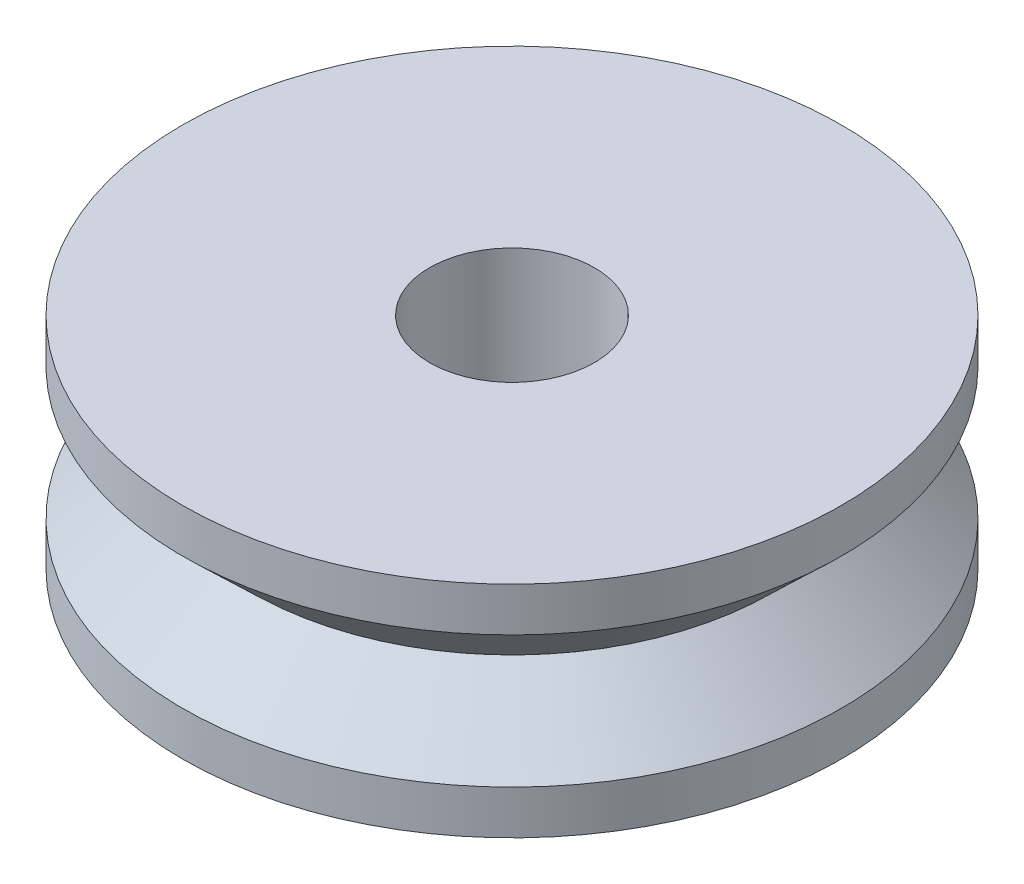
ISO-10303-21;
HEADER;
FILE_DESCRIPTION(('STEP AP214'),'2;1');
FILE_NAME('part.step','',(''),(''),'','','');
FILE_SCHEMA(('AUTOMOTIVE_DESIGN { 1 0 10303 214 1 1 1 1 }'));
ENDSEC;
DATA;
#1=APPLICATION_CONTEXT('core data for automotive mechanical design processes');
#2=APPLICATION_PROTOCOL_DEFINITION('international standard','automotive_design',2000,#1);
#3=PRODUCT_CONTEXT('',#1,'mechanical');
#4=PRODUCT('Part','Part','',(#3));
#5=PRODUCT_RELATED_PRODUCT_CATEGORY('part','',(#4));
#6=PRODUCT_DEFINITION_FORMATION('','',#4);
#7=PRODUCT_DEFINITION_CONTEXT('part definition',#1,'design');
#8=PRODUCT_DEFINITION('design','',#6,#7);
#9=PRODUCT_DEFINITION_SHAPE('','',#8);
#10=(LENGTH_UNIT() NAMED_UNIT(*) SI_UNIT(.MILLI.,.METRE.));
#11=(NAMED_UNIT(*) PLANE_ANGLE_UNIT() SI_UNIT($,.RADIAN.));
#12=(NAMED_UNIT(*) SI_UNIT($,.STERADIAN.) SOLID_ANGLE_UNIT());
#13=UNCERTAINTY_MEASURE_WITH_UNIT(LENGTH_MEASURE(1.E-05),#10,'distance_accuracy_value','');
#14=(GEOMETRIC_REPRESENTATION_CONTEXT(3) GLOBAL_UNCERTAINTY_ASSIGNED_CONTEXT((#13)) GLOBAL_UNIT_ASSIGNED_CONTEXT((#10,
#11,#12)) REPRESENTATION_CONTEXT('',''));
#15=CARTESIAN_POINT('',(0.,0.,0.));
#16=DIRECTION('',(0.,0.,1.));
#17=DIRECTION('',(1.,0.,0.));
#18=AXIS2_PLACEMENT_3D('',#15,#16,#17);
#19=CARTESIAN_POINT('',(0.,4.,0.));
#20=DIRECTION('',(0.,-1.,0.));
#21=DIRECTION('',(0.,0.,-1.));
#22=AXIS2_PLACEMENT_3D('',#19,#20,#21);
#23=CYLINDRICAL_SURFACE('',#22,6.);
#24=CARTESIAN_POINT('',(0.,4.,0.));
#25=DIRECTION('',(0.,1.,0.));
#26=DIRECTION('',(0.,0.,1.));
#27=AXIS2_PLACEMENT_3D('',#24,#25,#26);
#28=CIRCLE('',#27,6.);
#29=CARTESIAN_POINT('',(0.,4.,6.));
#30=VERTEX_POINT('',#29);
#31=EDGE_CURVE('E11',#30,#30,#28,.T.);
#32=ORIENTED_EDGE('',*,*,#31,.F.);
#33=EDGE_LOOP('',(#32));
#34=FACE_BOUND('',#33,.T.);
#35=CARTESIAN_POINT('',(0.,3.2,0.));
#36=DIRECTION('',(0.,-1.,0.));
#37=DIRECTION('',(0.,0.,-1.));
#38=AXIS2_PLACEMENT_3D('',#35,#36,#37);
#39=CIRCLE('',#38,6.);
#40=CARTESIAN_POINT('',(-6.,3.2,0.));
#41=VERTEX_POINT('',#40);
#42=EDGE_CURVE('E47',#41,#41,#39,.T.);
#43=ORIENTED_EDGE('',*,*,#42,.F.);
#44=EDGE_LOOP('',(#43));
#45=FACE_BOUND('',#44,.T.);
#46=ADVANCED_FACE('F33',(#34,#45),#23,.T.);
#47=CARTESIAN_POINT('',(0.,0.,0.));
#48=DIRECTION('',(0.,1.,0.));
#49=DIRECTION('',(0.,0.,1.));
#50=AXIS2_PLACEMENT_3D('',#47,#48,#49);
#51=CIRCLE('',#50,6.);
#52=CARTESIAN_POINT('',(0.,0.,6.));
#53=VERTEX_POINT('',#52);
#54=EDGE_CURVE('E36',#53,#53,#51,.T.);
#55=ORIENTED_EDGE('',*,*,#54,.T.);
#56=EDGE_LOOP('',(#55));
#57=FACE_BOUND('',#56,.T.);
#58=CARTESIAN_POINT('',(0.,0.8,0.));
#59=DIRECTION('',(0.,-1.,0.));
#60=DIRECTION('',(0.,0.,-1.));
#61=AXIS2_PLACEMENT_3D('',#58,#59,#60);
#62=CIRCLE('',#61,6.);
#63=CARTESIAN_POINT('',(-6.,0.8,0.));
#64=VERTEX_POINT('',#63);
#65=EDGE_CURVE('E60',#64,#64,#62,.T.);
#66=ORIENTED_EDGE('',*,*,#65,.T.);
#67=EDGE_LOOP('',(#66));
#68=FACE_BOUND('',#67,.T.);
#69=ADVANCED_FACE('F91',(#57,#68),#23,.T.);
#70=CARTESIAN_POINT('',(0.,4.,0.));
#71=DIRECTION('',(0.,1.,0.));
#72=DIRECTION('',(0.,0.,1.));
#73=AXIS2_PLACEMENT_3D('',#70,#71,#72);
#74=PLANE('',#73);
#75=ORIENTED_EDGE('',*,*,#31,.T.);
#76=EDGE_LOOP('',(#75));
#77=FACE_BOUND('',#76,.T.);
#78=CARTESIAN_POINT('',(0.,4.,0.));
#79=DIRECTION('',(0.,1.,0.));
#80=DIRECTION('',(0.,0.,1.));
#81=AXIS2_PLACEMENT_3D('',#78,#79,#80);
#82=CIRCLE('',#81,1.5);
#83=CARTESIAN_POINT('',(0.,4.,1.5));
#84=VERTEX_POINT('',#83);
#85=EDGE_CURVE('E70',#84,#84,#82,.T.);
#86=ORIENTED_EDGE('',*,*,#85,.F.);
#87=EDGE_LOOP('',(#86));
#88=FACE_BOUND('',#87,.T.);
#89=ADVANCED_FACE('F87',(#77,#88),#74,.T.);
#90=CARTESIAN_POINT('',(0.,0.,0.));
#91=DIRECTION('',(0.,1.,0.));
#92=DIRECTION('',(0.,0.,1.));
#93=AXIS2_PLACEMENT_3D('',#90,#91,#92);
#94=PLANE('',#93);
#95=ORIENTED_EDGE('',*,*,#54,.F.);
#96=EDGE_LOOP('',(#95));
#97=FACE_BOUND('',#96,.T.);
#98=CARTESIAN_POINT('',(0.,0.,0.));
#99=DIRECTION('',(0.,1.,0.));
#100=DIRECTION('',(0.,0.,1.));
#101=AXIS2_PLACEMENT_3D('',#98,#99,#100);
#102=CIRCLE('',#101,1.5);
#103=CARTESIAN_POINT('',(0.,0.,1.5));
#104=VERTEX_POINT('',#103);
#105=EDGE_CURVE('E59',#104,#104,#102,.T.);
#106=ORIENTED_EDGE('',*,*,#105,.T.);
#107=EDGE_LOOP('',(#106));
#108=FACE_BOUND('',#107,.T.);
#109=ADVANCED_FACE('F76',(#97,#108),#94,.F.);
#110=CARTESIAN_POINT('',(0.,4.,0.));
#111=DIRECTION('',(0.,-1.,0.));
#112=DIRECTION('',(0.,0.,-1.));
#113=AXIS2_PLACEMENT_3D('',#110,#111,#112);
#114=CYLINDRICAL_SURFACE('',#113,1.5);
#115=ORIENTED_EDGE('',*,*,#85,.T.);
#116=EDGE_LOOP('',(#115));
#117=FACE_BOUND('',#116,.T.);
#118=ORIENTED_EDGE('',*,*,#105,.F.);
#119=EDGE_LOOP('',(#118));
#120=FACE_BOUND('',#119,.T.);
#121=ADVANCED_FACE('F78',(#117,#120),#114,.F.);
#122=CARTESIAN_POINT('',(0.,2.,0.));
#123=DIRECTION('',(0.,1.,0.));
#124=DIRECTION('',(0.,0.,1.));
#125=AXIS2_PLACEMENT_3D('',#122,#123,#124);
#126=CONICAL_SURFACE('',#125,4.75,0.805803494083987);
#127=DIRECTION('',(-0.721387321030952,0.692531828189713,0.));
#128=VECTOR('',#127,1.);
#129=CARTESIAN_POINT('',(-6.,3.2,0.));
#130=LINE('',#129,#128);
#131=CARTESIAN_POINT('',(-4.75,2.,0.));
#132=VERTEX_POINT('',#131);
#133=EDGE_CURVE('E62',#132,#41,#130,.T.);
#134=ORIENTED_EDGE('',*,*,#133,.F.);
#135=CARTESIAN_POINT('',(0.,2.,0.));
#136=DIRECTION('',(0.,-1.,0.));
#137=DIRECTION('',(0.,0.,-1.));
#138=AXIS2_PLACEMENT_3D('',#135,#136,#137);
#139=CIRCLE('',#138,4.75);
#140=EDGE_CURVE('E57',#132,#132,#139,.T.);
#141=ORIENTED_EDGE('',*,*,#140,.F.);
#142=ORIENTED_EDGE('',*,*,#133,.T.);
#143=ORIENTED_EDGE('',*,*,#42,.T.);
#144=EDGE_LOOP('',(#134,#141,#142,#143));
#145=FACE_BOUND('',#144,.T.);
#146=ADVANCED_FACE('F63',(#145),#126,.T.);
#147=CARTESIAN_POINT('',(0.,0.8,0.));
#148=DIRECTION('',(0.,-1.,0.));
#149=DIRECTION('',(0.,0.,-1.));
#150=AXIS2_PLACEMENT_3D('',#147,#148,#149);
#151=CONICAL_SURFACE('',#150,6.,0.805803494083986);
#152=DIRECTION('',(0.721387321030951,0.692531828189713,0.));
#153=VECTOR('',#152,1.);
#154=CARTESIAN_POINT('',(-4.75,2.,0.));
#155=LINE('',#154,#153);
#156=EDGE_CURVE('E54',#64,#132,#155,.T.);
#157=ORIENTED_EDGE('',*,*,#156,.F.);
#158=ORIENTED_EDGE('',*,*,#65,.F.);
#159=ORIENTED_EDGE('',*,*,#156,.T.);
#160=ORIENTED_EDGE('',*,*,#140,.T.);
#161=EDGE_LOOP('',(#157,#158,#159,#160));
#162=FACE_BOUND('',#161,.T.);
#163=ADVANCED_FACE('F58',(#162),#151,.T.);
#164=CLOSED_SHELL('',(#46,#69,#89,#109,#121,#146,#163));
#165=MANIFOLD_SOLID_BREP('B2',#164);
#166=ADVANCED_BREP_SHAPE_REPRESENTATION('',(#18,#165),#14);
#167=SHAPE_DEFINITION_REPRESENTATION(#9,#166);
ENDSEC;
END-ISO-10303-21;
